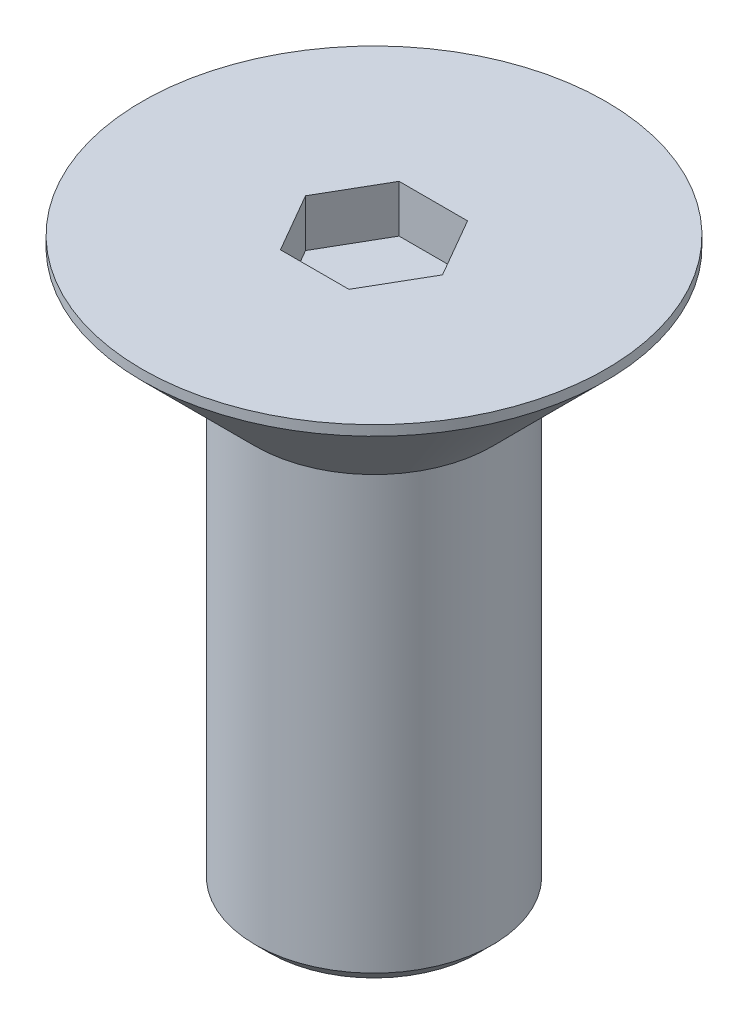
ISO-10303-21;
HEADER;
FILE_DESCRIPTION(('STEP AP214'),'2;1');
FILE_NAME('part.step','',(''),(''),'','','');
FILE_SCHEMA(('AUTOMOTIVE_DESIGN { 1 0 10303 214 1 1 1 1 }'));
ENDSEC;
DATA;
#1=APPLICATION_CONTEXT('core data for automotive mechanical design processes');
#2=APPLICATION_PROTOCOL_DEFINITION('international standard','automotive_design',2000,#1);
#3=PRODUCT_CONTEXT('',#1,'mechanical');
#4=PRODUCT('Part','Part','',(#3));
#5=PRODUCT_RELATED_PRODUCT_CATEGORY('part','',(#4));
#6=PRODUCT_DEFINITION_FORMATION('','',#4);
#7=PRODUCT_DEFINITION_CONTEXT('part definition',#1,'design');
#8=PRODUCT_DEFINITION('design','',#6,#7);
#9=PRODUCT_DEFINITION_SHAPE('','',#8);
#10=(LENGTH_UNIT() NAMED_UNIT(*) SI_UNIT(.MILLI.,.METRE.));
#11=(NAMED_UNIT(*) PLANE_ANGLE_UNIT() SI_UNIT($,.RADIAN.));
#12=(NAMED_UNIT(*) SI_UNIT($,.STERADIAN.) SOLID_ANGLE_UNIT());
#13=UNCERTAINTY_MEASURE_WITH_UNIT(LENGTH_MEASURE(1.E-05),#10,'distance_accuracy_value','');
#14=(GEOMETRIC_REPRESENTATION_CONTEXT(3) GLOBAL_UNCERTAINTY_ASSIGNED_CONTEXT((#13)) GLOBAL_UNIT_ASSIGNED_CONTEXT((#10,
#11,#12)) REPRESENTATION_CONTEXT('',''));
#15=CARTESIAN_POINT('',(0.,0.,0.));
#16=DIRECTION('',(0.,0.,1.));
#17=DIRECTION('',(1.,0.,0.));
#18=AXIS2_PLACEMENT_3D('',#15,#16,#17);
#19=CARTESIAN_POINT('',(0.,0.,0.));
#20=DIRECTION('',(0.,-1.,0.));
#21=DIRECTION('',(0.,0.,-1.));
#22=AXIS2_PLACEMENT_3D('',#19,#20,#21);
#23=PLANE('',#22);
#24=DIRECTION('',(-0.5,0.,0.866025403784439));
#25=VECTOR('',#24,1.);
#26=CARTESIAN_POINT('',(-0.721687836487032,0.,-1.25));
#27=LINE('',#26,#25);
#28=CARTESIAN_POINT('',(-0.721687836487032,0.,-1.25));
#29=VERTEX_POINT('',#28);
#30=CARTESIAN_POINT('',(-1.44337567297406,0.,0.));
#31=VERTEX_POINT('',#30);
#32=EDGE_CURVE('E124',#29,#31,#27,.T.);
#33=ORIENTED_EDGE('',*,*,#32,.F.);
#34=DIRECTION('',(-1.,0.,0.));
#35=VECTOR('',#34,1.);
#36=CARTESIAN_POINT('',(0.721687836487033,0.,-1.25));
#37=LINE('',#36,#35);
#38=CARTESIAN_POINT('',(0.721687836487033,0.,-1.25));
#39=VERTEX_POINT('',#38);
#40=EDGE_CURVE('E50',#39,#29,#37,.T.);
#41=ORIENTED_EDGE('',*,*,#40,.F.);
#42=DIRECTION('',(-0.5,0.,-0.866025403784439));
#43=VECTOR('',#42,1.);
#44=CARTESIAN_POINT('',(1.44337567297406,0.,0.));
#45=LINE('',#44,#43);
#46=CARTESIAN_POINT('',(1.44337567297406,0.,0.));
#47=VERTEX_POINT('',#46);
#48=EDGE_CURVE('E133',#47,#39,#45,.T.);
#49=ORIENTED_EDGE('',*,*,#48,.F.);
#50=DIRECTION('',(0.5,0.,-0.866025403784438));
#51=VECTOR('',#50,1.);
#52=CARTESIAN_POINT('',(0.721687836487032,0.,1.25));
#53=LINE('',#52,#51);
#54=CARTESIAN_POINT('',(0.721687836487032,0.,1.25));
#55=VERTEX_POINT('',#54);
#56=EDGE_CURVE('E131',#55,#47,#53,.T.);
#57=ORIENTED_EDGE('',*,*,#56,.F.);
#58=DIRECTION('',(1.,0.,0.));
#59=VECTOR('',#58,1.);
#60=CARTESIAN_POINT('',(-0.721687836487033,0.,1.25));
#61=LINE('',#60,#59);
#62=CARTESIAN_POINT('',(-0.721687836487033,0.,1.25));
#63=VERTEX_POINT('',#62);
#64=EDGE_CURVE('E98',#63,#55,#61,.T.);
#65=ORIENTED_EDGE('',*,*,#64,.F.);
#66=DIRECTION('',(0.5,0.,0.866025403784439));
#67=VECTOR('',#66,1.);
#68=CARTESIAN_POINT('',(-1.44337567297406,0.,0.));
#69=LINE('',#68,#67);
#70=EDGE_CURVE('E127',#31,#63,#69,.T.);
#71=ORIENTED_EDGE('',*,*,#70,.F.);
#72=EDGE_LOOP('',(#33,#41,#49,#57,#65,#71));
#73=FACE_BOUND('',#72,.T.);
#74=CARTESIAN_POINT('',(0.,0.,0.));
#75=DIRECTION('',(0.,-1.,0.));
#76=DIRECTION('',(0.,0.,-1.));
#77=AXIS2_PLACEMENT_3D('',#74,#75,#76);
#78=CIRCLE('',#77,4.88786796564401);
#79=CARTESIAN_POINT('',(0.,0.,-4.88786796564401));
#80=VERTEX_POINT('',#79);
#81=EDGE_CURVE('E145',#80,#80,#78,.F.);
#82=ORIENTED_EDGE('',*,*,#81,.T.);
#83=EDGE_LOOP('',(#82));
#84=FACE_BOUND('',#83,.T.);
#85=ADVANCED_FACE('F35',(#73,#84),#23,.F.);
#86=CARTESIAN_POINT('',(0.,-2.6,0.));
#87=DIRECTION('',(0.,1.,0.));
#88=DIRECTION('',(0.,0.,1.));
#89=AXIS2_PLACEMENT_3D('',#86,#87,#88);
#90=CONICAL_SURFACE('',#89,2.5,0.785398163397443);
#91=CARTESIAN_POINT('',(0.,-0.212132034355967,0.));
#92=DIRECTION('',(0.,-1.,0.));
#93=DIRECTION('',(0.,0.,-1.));
#94=AXIS2_PLACEMENT_3D('',#91,#92,#93);
#95=CIRCLE('',#94,4.88786796564401);
#96=CARTESIAN_POINT('',(0.,-0.212132034355967,-4.88786796564401));
#97=VERTEX_POINT('',#96);
#98=EDGE_CURVE('E148',#97,#97,#95,.T.);
#99=ORIENTED_EDGE('',*,*,#98,.T.);
#100=EDGE_LOOP('',(#99));
#101=FACE_BOUND('',#100,.T.);
#102=CARTESIAN_POINT('',(0.,-2.6,0.));
#103=DIRECTION('',(0.,1.,0.));
#104=DIRECTION('',(0.,0.,1.));
#105=AXIS2_PLACEMENT_3D('',#102,#103,#104);
#106=CIRCLE('',#105,2.5);
#107=CARTESIAN_POINT('',(0.,-2.6,2.5));
#108=VERTEX_POINT('',#107);
#109=EDGE_CURVE('E137',#108,#108,#106,.T.);
#110=ORIENTED_EDGE('',*,*,#109,.T.);
#111=EDGE_LOOP('',(#110));
#112=FACE_BOUND('',#111,.T.);
#113=ADVANCED_FACE('F170',(#101,#112),#90,.T.);
#114=CARTESIAN_POINT('',(0.,0.,0.));
#115=DIRECTION('',(0.,1.,0.));
#116=DIRECTION('',(0.,0.,1.));
#117=AXIS2_PLACEMENT_3D('',#114,#115,#116);
#118=CYLINDRICAL_SURFACE('',#117,2.5);
#119=CARTESIAN_POINT('',(0.,-11.7,0.));
#120=DIRECTION('',(0.,1.,0.));
#121=DIRECTION('',(0.,0.,1.));
#122=AXIS2_PLACEMENT_3D('',#119,#120,#121);
#123=CIRCLE('',#122,2.5);
#124=CARTESIAN_POINT('',(0.,-11.7,2.5));
#125=VERTEX_POINT('',#124);
#126=EDGE_CURVE('E43',#125,#125,#123,.T.);
#127=ORIENTED_EDGE('',*,*,#126,.T.);
#128=EDGE_LOOP('',(#127));
#129=FACE_BOUND('',#128,.T.);
#130=ORIENTED_EDGE('',*,*,#109,.F.);
#131=EDGE_LOOP('',(#130));
#132=FACE_BOUND('',#131,.T.);
#133=ADVANCED_FACE('F153',(#129,#132),#118,.T.);
#134=CARTESIAN_POINT('',(2.5,-12.,0.));
#135=DIRECTION('',(0.,1.,0.));
#136=DIRECTION('',(0.,0.,1.));
#137=AXIS2_PLACEMENT_3D('',#134,#135,#136);
#138=PLANE('',#137);
#139=CARTESIAN_POINT('',(0.,-12.,0.));
#140=DIRECTION('',(0.,1.,0.));
#141=DIRECTION('',(0.,0.,1.));
#142=AXIS2_PLACEMENT_3D('',#139,#140,#141);
#143=CIRCLE('',#142,2.2);
#144=CARTESIAN_POINT('',(0.,-12.,2.2));
#145=VERTEX_POINT('',#144);
#146=EDGE_CURVE('E11',#145,#145,#143,.F.);
#147=ORIENTED_EDGE('',*,*,#146,.T.);
#148=EDGE_LOOP('',(#147));
#149=FACE_BOUND('',#148,.T.);
#150=ADVANCED_FACE('F166',(#149),#138,.F.);
#151=CARTESIAN_POINT('',(0.,0.,0.));
#152=DIRECTION('',(0.,-1.,0.));
#153=DIRECTION('',(0.,0.,-1.));
#154=AXIS2_PLACEMENT_3D('',#151,#152,#153);
#155=CYLINDRICAL_SURFACE('',#154,4.88786796564401);
#156=ORIENTED_EDGE('',*,*,#98,.F.);
#157=EDGE_LOOP('',(#156));
#158=FACE_BOUND('',#157,.T.);
#159=ORIENTED_EDGE('',*,*,#81,.F.);
#160=EDGE_LOOP('',(#159));
#161=FACE_BOUND('',#160,.T.);
#162=ADVANCED_FACE('F158',(#158,#161),#155,.T.);
#163=CARTESIAN_POINT('',(0.,-11.7,0.));
#164=DIRECTION('',(0.,1.,0.));
#165=DIRECTION('',(0.,0.,1.));
#166=AXIS2_PLACEMENT_3D('',#163,#164,#165);
#167=CONICAL_SURFACE('',#166,2.5,0.785398163397455);
#168=ORIENTED_EDGE('',*,*,#146,.F.);
#169=EDGE_LOOP('',(#168));
#170=FACE_BOUND('',#169,.T.);
#171=ORIENTED_EDGE('',*,*,#126,.F.);
#172=EDGE_LOOP('',(#171));
#173=FACE_BOUND('',#172,.T.);
#174=ADVANCED_FACE('F37',(#170,#173),#167,.T.);
#175=CARTESIAN_POINT('',(0.721687836487033,-1.,-1.25));
#176=DIRECTION('',(0.,0.,-1.));
#177=DIRECTION('',(-1.,0.,0.));
#178=AXIS2_PLACEMENT_3D('',#175,#176,#177);
#179=PLANE('',#178);
#180=ORIENTED_EDGE('',*,*,#40,.T.);
#181=DIRECTION('',(0.,1.,0.));
#182=VECTOR('',#181,1.);
#183=CARTESIAN_POINT('',(-0.721687836487032,-1.,-1.25));
#184=LINE('',#183,#182);
#185=CARTESIAN_POINT('',(-0.721687836487032,-1.,-1.25));
#186=VERTEX_POINT('',#185);
#187=EDGE_CURVE('E80',#186,#29,#184,.T.);
#188=ORIENTED_EDGE('',*,*,#187,.F.);
#189=DIRECTION('',(-1.,0.,0.));
#190=VECTOR('',#189,1.);
#191=CARTESIAN_POINT('',(0.721687836487033,-1.,-1.25));
#192=LINE('',#191,#190);
#193=CARTESIAN_POINT('',(0.721687836487033,-1.,-1.25));
#194=VERTEX_POINT('',#193);
#195=EDGE_CURVE('E135',#194,#186,#192,.T.);
#196=ORIENTED_EDGE('',*,*,#195,.F.);
#197=DIRECTION('',(0.,1.,0.));
#198=VECTOR('',#197,1.);
#199=CARTESIAN_POINT('',(0.721687836487033,-1.,-1.25));
#200=LINE('',#199,#198);
#201=EDGE_CURVE('E58',#194,#39,#200,.T.);
#202=ORIENTED_EDGE('',*,*,#201,.T.);
#203=EDGE_LOOP('',(#180,#188,#196,#202));
#204=FACE_BOUND('',#203,.T.);
#205=ADVANCED_FACE('F157',(#204),#179,.F.);
#206=CARTESIAN_POINT('',(1.44337567297406,-1.,0.));
#207=DIRECTION('',(0.866025403784439,0.,-0.5));
#208=DIRECTION('',(-0.5,0.,-0.866025403784439));
#209=AXIS2_PLACEMENT_3D('',#206,#207,#208);
#210=PLANE('',#209);
#211=ORIENTED_EDGE('',*,*,#48,.T.);
#212=ORIENTED_EDGE('',*,*,#201,.F.);
#213=DIRECTION('',(-0.5,0.,-0.866025403784439));
#214=VECTOR('',#213,1.);
#215=CARTESIAN_POINT('',(1.44337567297406,-1.,0.));
#216=LINE('',#215,#214);
#217=CARTESIAN_POINT('',(1.44337567297406,-1.,0.));
#218=VERTEX_POINT('',#217);
#219=EDGE_CURVE('E110',#218,#194,#216,.T.);
#220=ORIENTED_EDGE('',*,*,#219,.F.);
#221=DIRECTION('',(0.,1.,0.));
#222=VECTOR('',#221,1.);
#223=CARTESIAN_POINT('',(1.44337567297406,-1.,0.));
#224=LINE('',#223,#222);
#225=EDGE_CURVE('E102',#218,#47,#224,.T.);
#226=ORIENTED_EDGE('',*,*,#225,.T.);
#227=EDGE_LOOP('',(#211,#212,#220,#226));
#228=FACE_BOUND('',#227,.T.);
#229=ADVANCED_FACE('F164',(#228),#210,.F.);
#230=CARTESIAN_POINT('',(0.721687836487032,-1.,1.25));
#231=DIRECTION('',(0.866025403784439,0.,0.5));
#232=DIRECTION('',(0.5,0.,-0.866025403784438));
#233=AXIS2_PLACEMENT_3D('',#230,#231,#232);
#234=PLANE('',#233);
#235=ORIENTED_EDGE('',*,*,#56,.T.);
#236=ORIENTED_EDGE('',*,*,#225,.F.);
#237=DIRECTION('',(0.5,0.,-0.866025403784438));
#238=VECTOR('',#237,1.);
#239=CARTESIAN_POINT('',(0.721687836487032,-1.,1.25));
#240=LINE('',#239,#238);
#241=CARTESIAN_POINT('',(0.721687836487032,-1.,1.25));
#242=VERTEX_POINT('',#241);
#243=EDGE_CURVE('E106',#242,#218,#240,.T.);
#244=ORIENTED_EDGE('',*,*,#243,.F.);
#245=DIRECTION('',(0.,1.,0.));
#246=VECTOR('',#245,1.);
#247=CARTESIAN_POINT('',(0.721687836487032,-1.,1.25));
#248=LINE('',#247,#246);
#249=EDGE_CURVE('E91',#242,#55,#248,.T.);
#250=ORIENTED_EDGE('',*,*,#249,.T.);
#251=EDGE_LOOP('',(#235,#236,#244,#250));
#252=FACE_BOUND('',#251,.T.);
#253=ADVANCED_FACE('F107',(#252),#234,.F.);
#254=CARTESIAN_POINT('',(-0.721687836487033,-1.,1.25));
#255=DIRECTION('',(0.,0.,1.));
#256=DIRECTION('',(1.,0.,0.));
#257=AXIS2_PLACEMENT_3D('',#254,#255,#256);
#258=PLANE('',#257);
#259=ORIENTED_EDGE('',*,*,#64,.T.);
#260=ORIENTED_EDGE('',*,*,#249,.F.);
#261=DIRECTION('',(1.,0.,0.));
#262=VECTOR('',#261,1.);
#263=CARTESIAN_POINT('',(-0.721687836487033,-1.,1.25));
#264=LINE('',#263,#262);
#265=CARTESIAN_POINT('',(-0.721687836487033,-1.,1.25));
#266=VERTEX_POINT('',#265);
#267=EDGE_CURVE('E95',#266,#242,#264,.T.);
#268=ORIENTED_EDGE('',*,*,#267,.F.);
#269=DIRECTION('',(0.,1.,0.));
#270=VECTOR('',#269,1.);
#271=CARTESIAN_POINT('',(-0.721687836487033,-1.,1.25));
#272=LINE('',#271,#270);
#273=EDGE_CURVE('E103',#266,#63,#272,.T.);
#274=ORIENTED_EDGE('',*,*,#273,.T.);
#275=EDGE_LOOP('',(#259,#260,#268,#274));
#276=FACE_BOUND('',#275,.T.);
#277=ADVANCED_FACE('F93',(#276),#258,.F.);
#278=CARTESIAN_POINT('',(-1.44337567297406,-1.,0.));
#279=DIRECTION('',(-0.866025403784439,0.,0.5));
#280=DIRECTION('',(0.5,0.,0.866025403784439));
#281=AXIS2_PLACEMENT_3D('',#278,#279,#280);
#282=PLANE('',#281);
#283=ORIENTED_EDGE('',*,*,#70,.T.);
#284=ORIENTED_EDGE('',*,*,#273,.F.);
#285=DIRECTION('',(0.5,0.,0.866025403784439));
#286=VECTOR('',#285,1.);
#287=CARTESIAN_POINT('',(-1.44337567297406,-1.,0.));
#288=LINE('',#287,#286);
#289=CARTESIAN_POINT('',(-1.44337567297406,-1.,0.));
#290=VERTEX_POINT('',#289);
#291=EDGE_CURVE('E116',#290,#266,#288,.T.);
#292=ORIENTED_EDGE('',*,*,#291,.F.);
#293=DIRECTION('',(0.,1.,0.));
#294=VECTOR('',#293,1.);
#295=CARTESIAN_POINT('',(-1.44337567297406,-1.,0.));
#296=LINE('',#295,#294);
#297=EDGE_CURVE('E140',#290,#31,#296,.T.);
#298=ORIENTED_EDGE('',*,*,#297,.T.);
#299=EDGE_LOOP('',(#283,#284,#292,#298));
#300=FACE_BOUND('',#299,.T.);
#301=ADVANCED_FACE('F189',(#300),#282,.F.);
#302=CARTESIAN_POINT('',(-0.721687836487032,-1.,-1.25));
#303=DIRECTION('',(-0.866025403784439,0.,-0.5));
#304=DIRECTION('',(-0.5,0.,0.866025403784439));
#305=AXIS2_PLACEMENT_3D('',#302,#303,#304);
#306=PLANE('',#305);
#307=ORIENTED_EDGE('',*,*,#32,.T.);
#308=ORIENTED_EDGE('',*,*,#297,.F.);
#309=DIRECTION('',(-0.5,0.,0.866025403784439));
#310=VECTOR('',#309,1.);
#311=CARTESIAN_POINT('',(-0.721687836487032,-1.,-1.25));
#312=LINE('',#311,#310);
#313=EDGE_CURVE('E118',#186,#290,#312,.T.);
#314=ORIENTED_EDGE('',*,*,#313,.F.);
#315=ORIENTED_EDGE('',*,*,#187,.T.);
#316=EDGE_LOOP('',(#307,#308,#314,#315));
#317=FACE_BOUND('',#316,.T.);
#318=ADVANCED_FACE('F186',(#317),#306,.F.);
#319=CARTESIAN_POINT('',(-0.721687836487032,-1.,-1.25));
#320=DIRECTION('',(0.,1.,0.));
#321=DIRECTION('',(0.,0.,1.));
#322=AXIS2_PLACEMENT_3D('',#319,#320,#321);
#323=PLANE('',#322);
#324=ORIENTED_EDGE('',*,*,#195,.T.);
#325=ORIENTED_EDGE('',*,*,#313,.T.);
#326=ORIENTED_EDGE('',*,*,#291,.T.);
#327=ORIENTED_EDGE('',*,*,#267,.T.);
#328=ORIENTED_EDGE('',*,*,#243,.T.);
#329=ORIENTED_EDGE('',*,*,#219,.T.);
#330=EDGE_LOOP('',(#324,#325,#326,#327,#328,#329));
#331=FACE_BOUND('',#330,.T.);
#332=ADVANCED_FACE('F113',(#331),#323,.T.);
#333=CLOSED_SHELL('',(#85,#113,#133,#150,#162,#174,#205,#229,#253,#277,#301,#318,#332));
#334=MANIFOLD_SOLID_BREP('B2',#333);
#335=ADVANCED_BREP_SHAPE_REPRESENTATION('',(#18,#334),#14);
#336=SHAPE_DEFINITION_REPRESENTATION(#9,#335);
ENDSEC;
END-ISO-10303-21;
